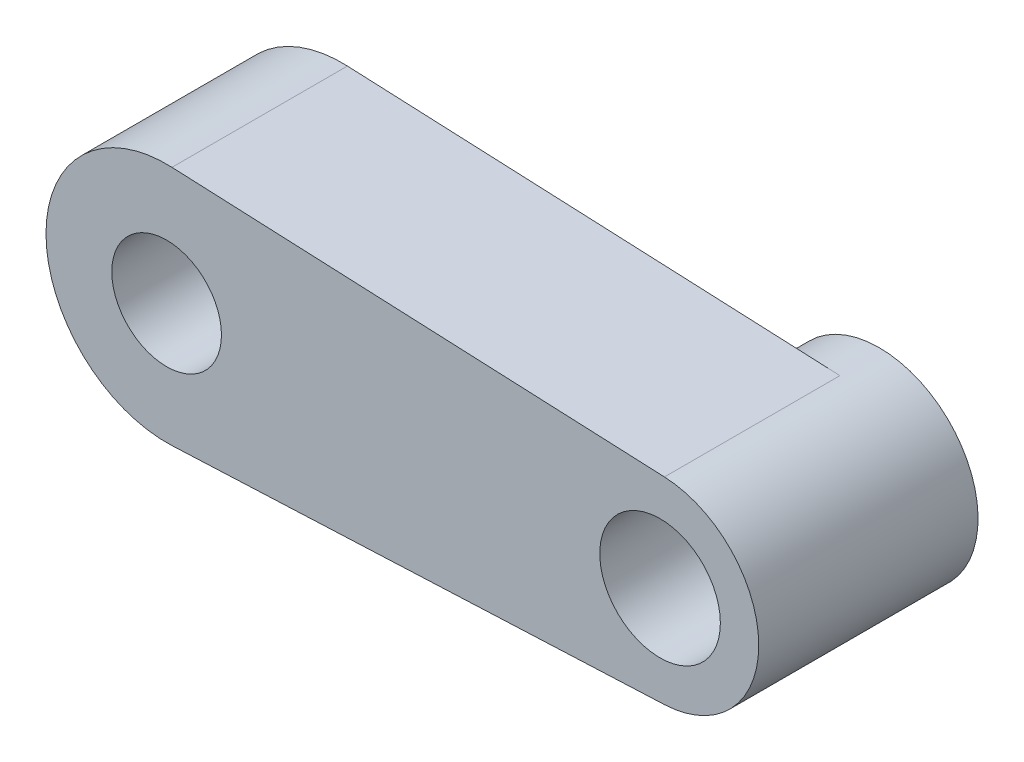
ISO-10303-21;
HEADER;
FILE_DESCRIPTION(('STEP AP214'),'2;1');
FILE_NAME('part.step','',(''),(''),'','','');
FILE_SCHEMA(('AUTOMOTIVE_DESIGN { 1 0 10303 214 1 1 1 1 }'));
ENDSEC;
DATA;
#1=APPLICATION_CONTEXT('core data for automotive mechanical design processes');
#2=APPLICATION_PROTOCOL_DEFINITION('international standard','automotive_design',2000,#1);
#3=PRODUCT_CONTEXT('',#1,'mechanical');
#4=PRODUCT('Part','Part','',(#3));
#5=PRODUCT_RELATED_PRODUCT_CATEGORY('part','',(#4));
#6=PRODUCT_DEFINITION_FORMATION('','',#4);
#7=PRODUCT_DEFINITION_CONTEXT('part definition',#1,'design');
#8=PRODUCT_DEFINITION('design','',#6,#7);
#9=PRODUCT_DEFINITION_SHAPE('','',#8);
#10=(LENGTH_UNIT() NAMED_UNIT(*) SI_UNIT(.MILLI.,.METRE.));
#11=(NAMED_UNIT(*) PLANE_ANGLE_UNIT() SI_UNIT($,.RADIAN.));
#12=(NAMED_UNIT(*) SI_UNIT($,.STERADIAN.) SOLID_ANGLE_UNIT());
#13=UNCERTAINTY_MEASURE_WITH_UNIT(LENGTH_MEASURE(1.E-05),#10,'distance_accuracy_value','');
#14=(GEOMETRIC_REPRESENTATION_CONTEXT(3) GLOBAL_UNCERTAINTY_ASSIGNED_CONTEXT((#13)) GLOBAL_UNIT_ASSIGNED_CONTEXT((#10,
#11,#12)) REPRESENTATION_CONTEXT('',''));
#15=CARTESIAN_POINT('',(0.,0.,0.));
#16=DIRECTION('',(0.,0.,1.));
#17=DIRECTION('',(1.,0.,0.));
#18=AXIS2_PLACEMENT_3D('',#15,#16,#17);
#19=CARTESIAN_POINT('',(105.,-9.95386915606983E-13,346.502));
#20=DIRECTION('',(0.,0.,-1.));
#21=DIRECTION('',(-1.,0.,0.));
#22=AXIS2_PLACEMENT_3D('',#19,#20,#21);
#23=CYLINDRICAL_SURFACE('',#22,5.);
#24=CARTESIAN_POINT('',(105.,-9.95386915606983E-13,346.5));
#25=DIRECTION('',(0.,0.,-1.));
#26=DIRECTION('',(1.,0.,0.));
#27=AXIS2_PLACEMENT_3D('',#24,#25,#26);
#28=CIRCLE('',#27,5.);
#29=CARTESIAN_POINT('',(110.,-9.95386915606983E-13,346.5));
#30=VERTEX_POINT('',#29);
#31=EDGE_CURVE('E28',#30,#30,#28,.T.);
#32=ORIENTED_EDGE('',*,*,#31,.F.);
#33=EDGE_LOOP('',(#32));
#34=FACE_BOUND('',#33,.T.);
#35=CARTESIAN_POINT('',(105.,-9.95386915606983E-13,336.5));
#36=DIRECTION('',(0.,0.,-1.));
#37=DIRECTION('',(-1.,0.,0.));
#38=AXIS2_PLACEMENT_3D('',#35,#36,#37);
#39=CIRCLE('',#38,5.);
#40=CARTESIAN_POINT('',(100.,-9.95386915606983E-13,336.5));
#41=VERTEX_POINT('',#40);
#42=EDGE_CURVE('E164',#41,#41,#39,.T.);
#43=ORIENTED_EDGE('',*,*,#42,.T.);
#44=EDGE_LOOP('',(#43));
#45=FACE_BOUND('',#44,.T.);
#46=ADVANCED_FACE('F17',(#34,#45),#23,.F.);
#47=CARTESIAN_POINT('',(150.,-1.16713212146263E-12,331.5));
#48=DIRECTION('',(0.,0.,1.));
#49=DIRECTION('',(1.,0.,0.));
#50=AXIS2_PLACEMENT_3D('',#47,#48,#49);
#51=CYLINDRICAL_SURFACE('',#50,5.5);
#52=CARTESIAN_POINT('',(150.,-1.16713212146263E-12,346.5));
#53=DIRECTION('',(0.,0.,1.));
#54=DIRECTION('',(1.,0.,0.));
#55=AXIS2_PLACEMENT_3D('',#52,#53,#54);
#56=CIRCLE('',#55,5.5);
#57=CARTESIAN_POINT('',(155.5,-1.16713212146263E-12,346.5));
#58=VERTEX_POINT('',#57);
#59=EDGE_CURVE('E11',#58,#58,#56,.T.);
#60=ORIENTED_EDGE('',*,*,#59,.T.);
#61=EDGE_LOOP('',(#60));
#62=FACE_BOUND('',#61,.T.);
#63=CARTESIAN_POINT('',(150.,-1.16713212146263E-12,331.5));
#64=DIRECTION('',(0.,0.,1.));
#65=DIRECTION('',(1.,0.,0.));
#66=AXIS2_PLACEMENT_3D('',#63,#64,#65);
#67=CIRCLE('',#66,5.5);
#68=CARTESIAN_POINT('',(155.5,-1.16713212146263E-12,331.5));
#69=VERTEX_POINT('',#68);
#70=EDGE_CURVE('E167',#69,#69,#67,.T.);
#71=ORIENTED_EDGE('',*,*,#70,.F.);
#72=EDGE_LOOP('',(#71));
#73=FACE_BOUND('',#72,.T.);
#74=ADVANCED_FACE('F282',(#62,#73),#51,.F.);
#75=CARTESIAN_POINT('',(126.5,-9.64506252643105E-13,346.5));
#76=DIRECTION('',(0.,0.,1.));
#77=DIRECTION('',(1.,0.,0.));
#78=AXIS2_PLACEMENT_3D('',#75,#76,#77);
#79=PLANE('',#78);
#80=DIRECTION('',(0.999011857466179,0.0444444444444446,0.));
#81=VECTOR('',#80,1.);
#82=CARTESIAN_POINT('',(127.944444444444,-9.99011857466277,346.5));
#83=LINE('',#82,#81);
#84=CARTESIAN_POINT('',(105.488888888889,-10.989130432129,346.5));
#85=VERTEX_POINT('',#84);
#86=CARTESIAN_POINT('',(150.4,-8.99110671719659,346.5));
#87=VERTEX_POINT('',#86);
#88=EDGE_CURVE('E151',#85,#87,#83,.T.);
#89=ORIENTED_EDGE('',*,*,#88,.T.);
#90=CARTESIAN_POINT('',(150.,-1.16746889933239E-12,346.5));
#91=DIRECTION('',(0.,0.,-1.));
#92=DIRECTION('',(1.,0.,0.));
#93=AXIS2_PLACEMENT_3D('',#90,#91,#92);
#94=CIRCLE('',#93,9.);
#95=CARTESIAN_POINT('',(150.4,8.99110671719463,346.5));
#96=VERTEX_POINT('',#95);
#97=EDGE_CURVE('E189',#96,#87,#94,.T.);
#98=ORIENTED_EDGE('',*,*,#97,.F.);
#99=DIRECTION('',(0.999011857466179,-0.0444444444444443,0.));
#100=VECTOR('',#99,1.);
#101=CARTESIAN_POINT('',(127.944444444444,9.9901185746608,346.5));
#102=LINE('',#101,#100);
#103=CARTESIAN_POINT('',(105.488888888889,10.989130432127,346.5));
#104=VERTEX_POINT('',#103);
#105=EDGE_CURVE('E162',#104,#96,#102,.T.);
#106=ORIENTED_EDGE('',*,*,#105,.F.);
#107=CARTESIAN_POINT('',(105.,-9.6501744436723E-13,346.5));
#108=DIRECTION('',(0.,0.,-1.));
#109=DIRECTION('',(-1.,0.,0.));
#110=AXIS2_PLACEMENT_3D('',#107,#108,#109);
#111=CIRCLE('',#110,11.);
#112=EDGE_CURVE('E175',#85,#104,#111,.T.);
#113=ORIENTED_EDGE('',*,*,#112,.F.);
#114=EDGE_LOOP('',(#89,#98,#106,#113));
#115=FACE_BOUND('',#114,.T.);
#116=ORIENTED_EDGE('',*,*,#59,.F.);
#117=EDGE_LOOP('',(#116));
#118=FACE_BOUND('',#117,.T.);
#119=ORIENTED_EDGE('',*,*,#31,.T.);
#120=EDGE_LOOP('',(#119));
#121=FACE_BOUND('',#120,.T.);
#122=ADVANCED_FACE('F230',(#115,#118,#121),#79,.T.);
#123=CARTESIAN_POINT('',(126.5,-9.64506252643105E-13,336.5));
#124=DIRECTION('',(0.,0.,1.));
#125=DIRECTION('',(1.,0.,0.));
#126=AXIS2_PLACEMENT_3D('',#123,#124,#125);
#127=PLANE('',#126);
#128=CARTESIAN_POINT('',(99.166369055211,-5.83363094478998,336.5));
#129=DIRECTION('',(0.,0.,1.));
#130=DIRECTION('',(-1.,0.,0.));
#131=AXIS2_PLACEMENT_3D('',#128,#129,#130);
#132=CIRCLE('',#131,1.75);
#133=CARTESIAN_POINT('',(97.416369055211,-5.83363094478998,336.5));
#134=VERTEX_POINT('',#133);
#135=EDGE_CURVE('E139',#134,#134,#132,.T.);
#136=ORIENTED_EDGE('',*,*,#135,.F.);
#137=EDGE_LOOP('',(#136));
#138=FACE_BOUND('',#137,.T.);
#139=ADVANCED_FACE('F19',(#138),#127,.F.);
#140=CARTESIAN_POINT('',(126.5,-9.64506252643105E-13,336.5));
#141=DIRECTION('',(0.,0.,1.));
#142=DIRECTION('',(1.,0.,0.));
#143=AXIS2_PLACEMENT_3D('',#140,#141,#142);
#144=PLANE('',#143);
#145=CARTESIAN_POINT('',(99.166369055211,5.83363094478805,336.5));
#146=DIRECTION('',(0.,0.,1.));
#147=DIRECTION('',(-1.,0.,0.));
#148=AXIS2_PLACEMENT_3D('',#145,#146,#147);
#149=CIRCLE('',#148,1.75);
#150=CARTESIAN_POINT('',(97.416369055211,5.83363094478805,336.5));
#151=VERTEX_POINT('',#150);
#152=EDGE_CURVE('E148',#151,#151,#149,.T.);
#153=ORIENTED_EDGE('',*,*,#152,.F.);
#154=EDGE_LOOP('',(#153));
#155=FACE_BOUND('',#154,.T.);
#156=ADVANCED_FACE('F267',(#155),#144,.F.);
#157=CARTESIAN_POINT('',(126.5,-9.64506252643105E-13,336.5));
#158=DIRECTION('',(0.,0.,1.));
#159=DIRECTION('',(1.,0.,0.));
#160=AXIS2_PLACEMENT_3D('',#157,#158,#159);
#161=PLANE('',#160);
#162=CARTESIAN_POINT('',(105.,-9.95080753907196E-13,336.5));
#163=DIRECTION('',(0.,0.,1.));
#164=DIRECTION('',(-1.,0.,0.));
#165=AXIS2_PLACEMENT_3D('',#162,#163,#164);
#166=CIRCLE('',#165,6.);
#167=CARTESIAN_POINT('',(99.,-9.95080753907196E-13,336.5));
#168=VERTEX_POINT('',#167);
#169=EDGE_CURVE('E181',#168,#168,#166,.T.);
#170=ORIENTED_EDGE('',*,*,#169,.F.);
#171=EDGE_LOOP('',(#170));
#172=FACE_BOUND('',#171,.T.);
#173=ORIENTED_EDGE('',*,*,#42,.F.);
#174=EDGE_LOOP('',(#173));
#175=FACE_BOUND('',#174,.T.);
#176=ADVANCED_FACE('F272',(#172,#175),#161,.F.);
#177=CARTESIAN_POINT('',(126.5,-9.64506252643105E-13,336.5));
#178=DIRECTION('',(0.,0.,1.));
#179=DIRECTION('',(1.,0.,0.));
#180=AXIS2_PLACEMENT_3D('',#177,#178,#179);
#181=PLANE('',#180);
#182=CARTESIAN_POINT('',(110.833630944789,5.83363094478807,336.5));
#183=DIRECTION('',(0.,0.,1.));
#184=DIRECTION('',(-1.,0.,0.));
#185=AXIS2_PLACEMENT_3D('',#182,#183,#184);
#186=CIRCLE('',#185,1.75);
#187=CARTESIAN_POINT('',(109.083630944789,5.83363094478807,336.5));
#188=VERTEX_POINT('',#187);
#189=EDGE_CURVE('E122',#188,#188,#186,.T.);
#190=ORIENTED_EDGE('',*,*,#189,.F.);
#191=EDGE_LOOP('',(#190));
#192=FACE_BOUND('',#191,.T.);
#193=ADVANCED_FACE('F260',(#192),#181,.F.);
#194=CARTESIAN_POINT('',(126.5,-9.64506252643105E-13,336.5));
#195=DIRECTION('',(0.,0.,1.));
#196=DIRECTION('',(1.,0.,0.));
#197=AXIS2_PLACEMENT_3D('',#194,#195,#196);
#198=PLANE('',#197);
#199=CARTESIAN_POINT('',(110.833630944789,-5.83363094478996,336.5));
#200=DIRECTION('',(0.,0.,1.));
#201=DIRECTION('',(-1.,0.,0.));
#202=AXIS2_PLACEMENT_3D('',#199,#200,#201);
#203=CIRCLE('',#202,1.75);
#204=CARTESIAN_POINT('',(109.083630944789,-5.83363094478996,336.5));
#205=VERTEX_POINT('',#204);
#206=EDGE_CURVE('E195',#205,#205,#203,.T.);
#207=ORIENTED_EDGE('',*,*,#206,.F.);
#208=EDGE_LOOP('',(#207));
#209=FACE_BOUND('',#208,.T.);
#210=ADVANCED_FACE('F254',(#209),#198,.F.);
#211=CARTESIAN_POINT('',(122.2,-9.64506252643105E-13,330.5));
#212=DIRECTION('',(0.,0.,-1.));
#213=DIRECTION('',(0.,-1.,0.));
#214=AXIS2_PLACEMENT_3D('',#211,#212,#213);
#215=PLANE('',#214);
#216=CARTESIAN_POINT('',(105.,-9.6501744436723E-13,330.5));
#217=DIRECTION('',(0.,0.,-1.));
#218=DIRECTION('',(-1.,0.,0.));
#219=AXIS2_PLACEMENT_3D('',#216,#217,#218);
#220=CIRCLE('',#219,11.);
#221=CARTESIAN_POINT('',(105.488888888889,-10.9891304321289,330.5));
#222=VERTEX_POINT('',#221);
#223=CARTESIAN_POINT('',(105.488888888889,10.989130432127,330.5));
#224=VERTEX_POINT('',#223);
#225=EDGE_CURVE('E201',#222,#224,#220,.T.);
#226=ORIENTED_EDGE('',*,*,#225,.T.);
#227=DIRECTION('',(0.999011857466179,-0.0444444444444443,0.));
#228=VECTOR('',#227,1.);
#229=CARTESIAN_POINT('',(127.944444444444,9.9901185746608,330.5));
#230=LINE('',#229,#228);
#231=CARTESIAN_POINT('',(150.4,8.99110671719454,330.5));
#232=VERTEX_POINT('',#231);
#233=EDGE_CURVE('E160',#224,#232,#230,.T.);
#234=ORIENTED_EDGE('',*,*,#233,.T.);
#235=CARTESIAN_POINT('',(150.,-1.16746889933239E-12,330.5));
#236=DIRECTION('',(0.,0.,-1.));
#237=DIRECTION('',(-1.,0.,0.));
#238=AXIS2_PLACEMENT_3D('',#235,#236,#237);
#239=CIRCLE('',#238,9.);
#240=CARTESIAN_POINT('',(150.4,-8.99110671719659,330.5));
#241=VERTEX_POINT('',#240);
#242=EDGE_CURVE('E155',#241,#232,#239,.T.);
#243=ORIENTED_EDGE('',*,*,#242,.F.);
#244=DIRECTION('',(0.999011857466179,0.0444444444444446,0.));
#245=VECTOR('',#244,1.);
#246=CARTESIAN_POINT('',(127.944444444444,-9.99011857466277,330.5));
#247=LINE('',#246,#245);
#248=EDGE_CURVE('E143',#222,#241,#247,.T.);
#249=ORIENTED_EDGE('',*,*,#248,.F.);
#250=EDGE_LOOP('',(#226,#234,#243,#249));
#251=FACE_BOUND('',#250,.T.);
#252=CARTESIAN_POINT('',(99.166369055211,-5.83363094478998,330.5));
#253=DIRECTION('',(0.,0.,-1.));
#254=DIRECTION('',(-1.,0.,0.));
#255=AXIS2_PLACEMENT_3D('',#252,#253,#254);
#256=CIRCLE('',#255,1.75);
#257=CARTESIAN_POINT('',(97.416369055211,-5.83363094478998,330.5));
#258=VERTEX_POINT('',#257);
#259=EDGE_CURVE('E134',#258,#258,#256,.T.);
#260=ORIENTED_EDGE('',*,*,#259,.F.);
#261=EDGE_LOOP('',(#260));
#262=FACE_BOUND('',#261,.T.);
#263=CARTESIAN_POINT('',(99.166369055211,5.83363094478805,330.5));
#264=DIRECTION('',(0.,0.,-1.));
#265=DIRECTION('',(-1.,0.,0.));
#266=AXIS2_PLACEMENT_3D('',#263,#264,#265);
#267=CIRCLE('',#266,1.75);
#268=CARTESIAN_POINT('',(97.416369055211,5.83363094478805,330.5));
#269=VERTEX_POINT('',#268);
#270=EDGE_CURVE('E178',#269,#269,#267,.T.);
#271=ORIENTED_EDGE('',*,*,#270,.F.);
#272=EDGE_LOOP('',(#271));
#273=FACE_BOUND('',#272,.T.);
#274=CARTESIAN_POINT('',(105.,-9.95080753907196E-13,330.5));
#275=DIRECTION('',(0.,0.,-1.));
#276=DIRECTION('',(-1.,0.,0.));
#277=AXIS2_PLACEMENT_3D('',#274,#275,#276);
#278=CIRCLE('',#277,6.);
#279=CARTESIAN_POINT('',(99.,-9.95080753907196E-13,330.5));
#280=VERTEX_POINT('',#279);
#281=EDGE_CURVE('E200',#280,#280,#278,.T.);
#282=ORIENTED_EDGE('',*,*,#281,.F.);
#283=EDGE_LOOP('',(#282));
#284=FACE_BOUND('',#283,.T.);
#285=CARTESIAN_POINT('',(110.833630944789,5.83363094478807,330.5));
#286=DIRECTION('',(0.,0.,-1.));
#287=DIRECTION('',(-1.,0.,0.));
#288=AXIS2_PLACEMENT_3D('',#285,#286,#287);
#289=CIRCLE('',#288,1.75);
#290=CARTESIAN_POINT('',(109.083630944789,5.83363094478807,330.5));
#291=VERTEX_POINT('',#290);
#292=EDGE_CURVE('E114',#291,#291,#289,.T.);
#293=ORIENTED_EDGE('',*,*,#292,.F.);
#294=EDGE_LOOP('',(#293));
#295=FACE_BOUND('',#294,.T.);
#296=CARTESIAN_POINT('',(110.833630944789,-5.83363094478996,330.5));
#297=DIRECTION('',(0.,0.,-1.));
#298=DIRECTION('',(-1.,0.,0.));
#299=AXIS2_PLACEMENT_3D('',#296,#297,#298);
#300=CIRCLE('',#299,1.75);
#301=CARTESIAN_POINT('',(109.083630944789,-5.83363094478996,330.5));
#302=VERTEX_POINT('',#301);
#303=EDGE_CURVE('E186',#302,#302,#300,.T.);
#304=ORIENTED_EDGE('',*,*,#303,.F.);
#305=EDGE_LOOP('',(#304));
#306=FACE_BOUND('',#305,.T.);
#307=ADVANCED_FACE('F259',(#251,#262,#273,#284,#295,#306),#215,.T.);
#308=CARTESIAN_POINT('',(127.5,-9.85322934354826E-13,331.5));
#309=DIRECTION('',(0.,0.,-1.));
#310=DIRECTION('',(0.,-1.,0.));
#311=AXIS2_PLACEMENT_3D('',#308,#309,#310);
#312=PLANE('',#311);
#313=CARTESIAN_POINT('',(150.,-1.16789752571209E-12,331.5));
#314=DIRECTION('',(0.,0.,-1.));
#315=DIRECTION('',(-1.,0.,0.));
#316=AXIS2_PLACEMENT_3D('',#313,#314,#315);
#317=CIRCLE('',#316,7.);
#318=CARTESIAN_POINT('',(143.,-1.16789752571209E-12,331.5));
#319=VERTEX_POINT('',#318);
#320=EDGE_CURVE('E171',#319,#319,#317,.T.);
#321=ORIENTED_EDGE('',*,*,#320,.T.);
#322=EDGE_LOOP('',(#321));
#323=FACE_BOUND('',#322,.T.);
#324=ORIENTED_EDGE('',*,*,#70,.T.);
#325=EDGE_LOOP('',(#324));
#326=FACE_BOUND('',#325,.T.);
#327=ADVANCED_FACE('F301',(#323,#326),#312,.T.);
#328=CARTESIAN_POINT('',(126.5,-9.64506252643105E-13,326.5));
#329=DIRECTION('',(0.,0.,-1.));
#330=DIRECTION('',(0.,-1.,0.));
#331=AXIS2_PLACEMENT_3D('',#328,#329,#330);
#332=PLANE('',#331);
#333=CARTESIAN_POINT('',(150.,-1.16746889933239E-12,326.5));
#334=DIRECTION('',(0.,0.,-1.));
#335=DIRECTION('',(-1.,0.,0.));
#336=AXIS2_PLACEMENT_3D('',#333,#334,#335);
#337=CIRCLE('',#336,9.);
#338=CARTESIAN_POINT('',(141.,-1.16746889933239E-12,326.5));
#339=VERTEX_POINT('',#338);
#340=EDGE_CURVE('E172',#339,#339,#337,.T.);
#341=ORIENTED_EDGE('',*,*,#340,.T.);
#342=EDGE_LOOP('',(#341));
#343=FACE_BOUND('',#342,.T.);
#344=CARTESIAN_POINT('',(150.,-1.16789752571209E-12,326.5));
#345=DIRECTION('',(0.,0.,-1.));
#346=DIRECTION('',(-1.,0.,0.));
#347=AXIS2_PLACEMENT_3D('',#344,#345,#346);
#348=CIRCLE('',#347,7.);
#349=CARTESIAN_POINT('',(143.,-1.16789752571209E-12,326.5));
#350=VERTEX_POINT('',#349);
#351=EDGE_CURVE('E182',#350,#350,#348,.T.);
#352=ORIENTED_EDGE('',*,*,#351,.F.);
#353=EDGE_LOOP('',(#352));
#354=FACE_BOUND('',#353,.T.);
#355=ADVANCED_FACE('F295',(#343,#354),#332,.T.);
#356=CARTESIAN_POINT('',(150.,-1.16789752571209E-12,326.5));
#357=DIRECTION('',(0.,0.,1.));
#358=DIRECTION('',(1.,0.,0.));
#359=AXIS2_PLACEMENT_3D('',#356,#357,#358);
#360=CYLINDRICAL_SURFACE('',#359,7.);
#361=ORIENTED_EDGE('',*,*,#320,.F.);
#362=EDGE_LOOP('',(#361));
#363=FACE_BOUND('',#362,.T.);
#364=ORIENTED_EDGE('',*,*,#351,.T.);
#365=EDGE_LOOP('',(#364));
#366=FACE_BOUND('',#365,.T.);
#367=ADVANCED_FACE('F300',(#363,#366),#360,.F.);
#368=CARTESIAN_POINT('',(110.833630944789,-5.83363094478996,333.502));
#369=DIRECTION('',(0.,0.,-1.));
#370=DIRECTION('',(-1.,0.,0.));
#371=AXIS2_PLACEMENT_3D('',#368,#369,#370);
#372=CYLINDRICAL_SURFACE('',#371,1.75);
#373=ORIENTED_EDGE('',*,*,#303,.T.);
#374=EDGE_LOOP('',(#373));
#375=FACE_BOUND('',#374,.T.);
#376=ORIENTED_EDGE('',*,*,#206,.T.);
#377=EDGE_LOOP('',(#376));
#378=FACE_BOUND('',#377,.T.);
#379=ADVANCED_FACE('F326',(#375,#378),#372,.F.);
#380=CARTESIAN_POINT('',(110.833630944789,5.83363094478807,333.502));
#381=DIRECTION('',(0.,0.,-1.));
#382=DIRECTION('',(-1.,0.,0.));
#383=AXIS2_PLACEMENT_3D('',#380,#381,#382);
#384=CYLINDRICAL_SURFACE('',#383,1.75);
#385=ORIENTED_EDGE('',*,*,#292,.T.);
#386=EDGE_LOOP('',(#385));
#387=FACE_BOUND('',#386,.T.);
#388=ORIENTED_EDGE('',*,*,#189,.T.);
#389=EDGE_LOOP('',(#388));
#390=FACE_BOUND('',#389,.T.);
#391=ADVANCED_FACE('F246',(#387,#390),#384,.F.);
#392=CARTESIAN_POINT('',(105.,-9.95080753907196E-13,333.502));
#393=DIRECTION('',(0.,0.,-1.));
#394=DIRECTION('',(-1.,0.,0.));
#395=AXIS2_PLACEMENT_3D('',#392,#393,#394);
#396=CYLINDRICAL_SURFACE('',#395,6.);
#397=ORIENTED_EDGE('',*,*,#281,.T.);
#398=EDGE_LOOP('',(#397));
#399=FACE_BOUND('',#398,.T.);
#400=ORIENTED_EDGE('',*,*,#169,.T.);
#401=EDGE_LOOP('',(#400));
#402=FACE_BOUND('',#401,.T.);
#403=ADVANCED_FACE('F240',(#399,#402),#396,.F.);
#404=CARTESIAN_POINT('',(99.166369055211,5.83363094478805,333.502));
#405=DIRECTION('',(0.,0.,-1.));
#406=DIRECTION('',(-1.,0.,0.));
#407=AXIS2_PLACEMENT_3D('',#404,#405,#406);
#408=CYLINDRICAL_SURFACE('',#407,1.75);
#409=ORIENTED_EDGE('',*,*,#270,.T.);
#410=EDGE_LOOP('',(#409));
#411=FACE_BOUND('',#410,.T.);
#412=ORIENTED_EDGE('',*,*,#152,.T.);
#413=EDGE_LOOP('',(#412));
#414=FACE_BOUND('',#413,.T.);
#415=ADVANCED_FACE('F245',(#411,#414),#408,.F.);
#416=CARTESIAN_POINT('',(99.166369055211,-5.83363094478998,333.502));
#417=DIRECTION('',(0.,0.,-1.));
#418=DIRECTION('',(-1.,0.,0.));
#419=AXIS2_PLACEMENT_3D('',#416,#417,#418);
#420=CYLINDRICAL_SURFACE('',#419,1.75);
#421=ORIENTED_EDGE('',*,*,#259,.T.);
#422=EDGE_LOOP('',(#421));
#423=FACE_BOUND('',#422,.T.);
#424=ORIENTED_EDGE('',*,*,#135,.T.);
#425=EDGE_LOOP('',(#424));
#426=FACE_BOUND('',#425,.T.);
#427=ADVANCED_FACE('F140',(#423,#426),#420,.F.);
#428=CARTESIAN_POINT('',(127.944444444444,-9.99011857466277,331.5));
#429=DIRECTION('',(0.0444444444444446,-0.999011857466179,0.));
#430=DIRECTION('',(0.,0.,-1.));
#431=AXIS2_PLACEMENT_3D('',#428,#429,#430);
#432=PLANE('',#431);
#433=DIRECTION('',(0.,0.,1.));
#434=VECTOR('',#433,1.);
#435=CARTESIAN_POINT('',(150.4,-8.99110671719659,331.5));
#436=LINE('',#435,#434);
#437=EDGE_CURVE('E159',#241,#87,#436,.T.);
#438=ORIENTED_EDGE('',*,*,#437,.T.);
#439=ORIENTED_EDGE('',*,*,#88,.F.);
#440=DIRECTION('',(0.,0.,1.));
#441=VECTOR('',#440,1.);
#442=CARTESIAN_POINT('',(105.488888888889,-10.9891304321289,331.5));
#443=LINE('',#442,#441);
#444=EDGE_CURVE('E205',#222,#85,#443,.T.);
#445=ORIENTED_EDGE('',*,*,#444,.F.);
#446=ORIENTED_EDGE('',*,*,#248,.T.);
#447=EDGE_LOOP('',(#438,#439,#445,#446));
#448=FACE_BOUND('',#447,.T.);
#449=ADVANCED_FACE('F225',(#448),#432,.T.);
#450=CARTESIAN_POINT('',(127.944444444444,9.9901185746608,331.5));
#451=DIRECTION('',(-0.0444444444444443,-0.999011857466179,0.));
#452=DIRECTION('',(-0.999011857466179,0.0444444444444443,0.));
#453=AXIS2_PLACEMENT_3D('',#450,#451,#452);
#454=PLANE('',#453);
#455=DIRECTION('',(0.,0.,1.));
#456=VECTOR('',#455,1.);
#457=CARTESIAN_POINT('',(105.488888888889,10.989130432127,331.5));
#458=LINE('',#457,#456);
#459=EDGE_CURVE('E21',#224,#104,#458,.T.);
#460=ORIENTED_EDGE('',*,*,#459,.T.);
#461=ORIENTED_EDGE('',*,*,#105,.T.);
#462=DIRECTION('',(0.,0.,1.));
#463=VECTOR('',#462,1.);
#464=CARTESIAN_POINT('',(150.4,8.99110671719463,331.5));
#465=LINE('',#464,#463);
#466=EDGE_CURVE('E158',#232,#96,#465,.T.);
#467=ORIENTED_EDGE('',*,*,#466,.F.);
#468=ORIENTED_EDGE('',*,*,#233,.F.);
#469=EDGE_LOOP('',(#460,#461,#467,#468));
#470=FACE_BOUND('',#469,.T.);
#471=ADVANCED_FACE('F235',(#470),#454,.F.);
#472=CARTESIAN_POINT('',(150.,-1.16746889933239E-12,331.5));
#473=DIRECTION('',(0.,0.,1.));
#474=DIRECTION('',(1.,0.,0.));
#475=AXIS2_PLACEMENT_3D('',#472,#473,#474);
#476=CYLINDRICAL_SURFACE('',#475,9.);
#477=ORIENTED_EDGE('',*,*,#437,.F.);
#478=ORIENTED_EDGE('',*,*,#242,.T.);
#479=ORIENTED_EDGE('',*,*,#466,.T.);
#480=ORIENTED_EDGE('',*,*,#97,.T.);
#481=EDGE_LOOP('',(#477,#478,#479,#480));
#482=FACE_BOUND('',#481,.T.);
#483=ORIENTED_EDGE('',*,*,#340,.F.);
#484=EDGE_LOOP('',(#483));
#485=FACE_BOUND('',#484,.T.);
#486=ADVANCED_FACE('F290',(#482,#485),#476,.T.);
#487=CARTESIAN_POINT('',(105.,-9.6501744436723E-13,331.5));
#488=DIRECTION('',(0.,0.,1.));
#489=DIRECTION('',(1.,0.,0.));
#490=AXIS2_PLACEMENT_3D('',#487,#488,#489);
#491=CYLINDRICAL_SURFACE('',#490,11.);
#492=ORIENTED_EDGE('',*,*,#459,.F.);
#493=ORIENTED_EDGE('',*,*,#225,.F.);
#494=ORIENTED_EDGE('',*,*,#444,.T.);
#495=ORIENTED_EDGE('',*,*,#112,.T.);
#496=EDGE_LOOP('',(#492,#493,#494,#495));
#497=FACE_BOUND('',#496,.T.);
#498=ADVANCED_FACE('F220',(#497),#491,.T.);
#499=CLOSED_SHELL('',(#46,#74,#122,#139,#156,#176,#193,#210,#307,#327,#355,#367,#379,#391,#403,
#415,#427,#449,#471,#486,#498));
#500=MANIFOLD_SOLID_BREP('B1',#499);
#501=ADVANCED_BREP_SHAPE_REPRESENTATION('',(#18,#500),#14);
#502=SHAPE_DEFINITION_REPRESENTATION(#9,#501);
ENDSEC;
END-ISO-10303-21;
